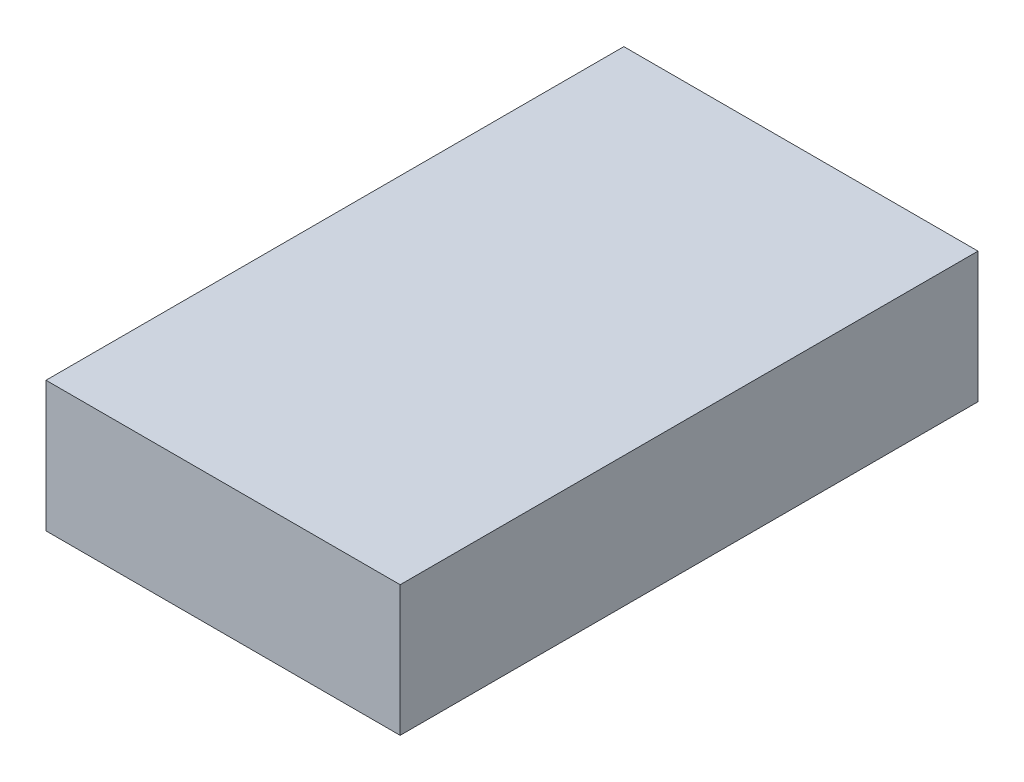
ISO-10303-21;
HEADER;
FILE_DESCRIPTION(('STEP AP214'),'2;1');
FILE_NAME('part.step','',(''),(''),'','','');
FILE_SCHEMA(('AUTOMOTIVE_DESIGN { 1 0 10303 214 1 1 1 1 }'));
ENDSEC;
DATA;
#1=APPLICATION_CONTEXT('core data for automotive mechanical design processes');
#2=APPLICATION_PROTOCOL_DEFINITION('international standard','automotive_design',2000,#1);
#3=PRODUCT_CONTEXT('',#1,'mechanical');
#4=PRODUCT('Part','Part','',(#3));
#5=PRODUCT_RELATED_PRODUCT_CATEGORY('part','',(#4));
#6=PRODUCT_DEFINITION_FORMATION('','',#4);
#7=PRODUCT_DEFINITION_CONTEXT('part definition',#1,'design');
#8=PRODUCT_DEFINITION('design','',#6,#7);
#9=PRODUCT_DEFINITION_SHAPE('','',#8);
#10=(LENGTH_UNIT() NAMED_UNIT(*) SI_UNIT(.MILLI.,.METRE.));
#11=(NAMED_UNIT(*) PLANE_ANGLE_UNIT() SI_UNIT($,.RADIAN.));
#12=(NAMED_UNIT(*) SI_UNIT($,.STERADIAN.) SOLID_ANGLE_UNIT());
#13=UNCERTAINTY_MEASURE_WITH_UNIT(LENGTH_MEASURE(1.E-05),#10,'distance_accuracy_value','');
#14=(GEOMETRIC_REPRESENTATION_CONTEXT(3) GLOBAL_UNCERTAINTY_ASSIGNED_CONTEXT((#13)) GLOBAL_UNIT_ASSIGNED_CONTEXT((#10,
#11,#12)) REPRESENTATION_CONTEXT('',''));
#15=CARTESIAN_POINT('',(0.,0.,0.));
#16=DIRECTION('',(0.,0.,1.));
#17=DIRECTION('',(1.,0.,0.));
#18=AXIS2_PLACEMENT_3D('',#15,#16,#17);
#19=CARTESIAN_POINT('',(0.,17.78,0.));
#20=DIRECTION('',(1.,0.,0.));
#21=DIRECTION('',(0.,0.,-1.));
#22=AXIS2_PLACEMENT_3D('',#19,#20,#21);
#23=PLANE('',#22);
#24=DIRECTION('',(0.,0.,1.));
#25=VECTOR('',#24,1.);
#26=CARTESIAN_POINT('',(0.,0.,0.));
#27=LINE('',#26,#25);
#28=CARTESIAN_POINT('',(0.,0.,-78.74));
#29=VERTEX_POINT('',#28);
#30=CARTESIAN_POINT('',(0.,0.,0.));
#31=VERTEX_POINT('',#30);
#32=EDGE_CURVE('E107',#29,#31,#27,.T.);
#33=ORIENTED_EDGE('',*,*,#32,.T.);
#34=DIRECTION('',(0.,-1.,0.));
#35=VECTOR('',#34,1.);
#36=CARTESIAN_POINT('',(0.,17.78,0.));
#37=LINE('',#36,#35);
#38=CARTESIAN_POINT('',(0.,17.78,0.));
#39=VERTEX_POINT('',#38);
#40=EDGE_CURVE('E11',#39,#31,#37,.T.);
#41=ORIENTED_EDGE('',*,*,#40,.F.);
#42=DIRECTION('',(0.,0.,1.));
#43=VECTOR('',#42,1.);
#44=CARTESIAN_POINT('',(0.,17.78,0.));
#45=LINE('',#44,#43);
#46=CARTESIAN_POINT('',(0.,17.78,-78.74));
#47=VERTEX_POINT('',#46);
#48=EDGE_CURVE('E91',#47,#39,#45,.T.);
#49=ORIENTED_EDGE('',*,*,#48,.F.);
#50=DIRECTION('',(0.,-1.,0.));
#51=VECTOR('',#50,1.);
#52=CARTESIAN_POINT('',(0.,17.78,-78.74));
#53=LINE('',#52,#51);
#54=EDGE_CURVE('E103',#47,#29,#53,.T.);
#55=ORIENTED_EDGE('',*,*,#54,.T.);
#56=EDGE_LOOP('',(#33,#41,#49,#55));
#57=FACE_BOUND('',#56,.T.);
#58=ADVANCED_FACE('F39',(#57),#23,.F.);
#59=CARTESIAN_POINT('',(0.,17.78,0.));
#60=DIRECTION('',(0.,0.,-1.));
#61=DIRECTION('',(-1.,0.,0.));
#62=AXIS2_PLACEMENT_3D('',#59,#60,#61);
#63=PLANE('',#62);
#64=DIRECTION('',(1.,0.,0.));
#65=VECTOR('',#64,1.);
#66=CARTESIAN_POINT('',(0.,0.,0.));
#67=LINE('',#66,#65);
#68=CARTESIAN_POINT('',(48.26,0.,0.));
#69=VERTEX_POINT('',#68);
#70=EDGE_CURVE('E96',#31,#69,#67,.T.);
#71=ORIENTED_EDGE('',*,*,#70,.T.);
#72=DIRECTION('',(0.,-1.,0.));
#73=VECTOR('',#72,1.);
#74=CARTESIAN_POINT('',(48.26,17.78,0.));
#75=LINE('',#74,#73);
#76=CARTESIAN_POINT('',(48.26,17.78,0.));
#77=VERTEX_POINT('',#76);
#78=EDGE_CURVE('E48',#77,#69,#75,.T.);
#79=ORIENTED_EDGE('',*,*,#78,.F.);
#80=DIRECTION('',(1.,0.,0.));
#81=VECTOR('',#80,1.);
#82=CARTESIAN_POINT('',(0.,17.78,0.));
#83=LINE('',#82,#81);
#84=EDGE_CURVE('E86',#39,#77,#83,.T.);
#85=ORIENTED_EDGE('',*,*,#84,.F.);
#86=ORIENTED_EDGE('',*,*,#40,.T.);
#87=EDGE_LOOP('',(#71,#79,#85,#86));
#88=FACE_BOUND('',#87,.T.);
#89=ADVANCED_FACE('F95',(#88),#63,.F.);
#90=CARTESIAN_POINT('',(48.26,17.78,0.));
#91=DIRECTION('',(-1.,0.,0.));
#92=DIRECTION('',(0.,0.,1.));
#93=AXIS2_PLACEMENT_3D('',#90,#91,#92);
#94=PLANE('',#93);
#95=DIRECTION('',(0.,0.,-1.));
#96=VECTOR('',#95,1.);
#97=CARTESIAN_POINT('',(48.26,0.,0.));
#98=LINE('',#97,#96);
#99=CARTESIAN_POINT('',(48.26,0.,-78.74));
#100=VERTEX_POINT('',#99);
#101=EDGE_CURVE('E73',#69,#100,#98,.T.);
#102=ORIENTED_EDGE('',*,*,#101,.T.);
#103=DIRECTION('',(0.,-1.,0.));
#104=VECTOR('',#103,1.);
#105=CARTESIAN_POINT('',(48.26,17.78,-78.74));
#106=LINE('',#105,#104);
#107=CARTESIAN_POINT('',(48.26,17.78,-78.74));
#108=VERTEX_POINT('',#107);
#109=EDGE_CURVE('E98',#108,#100,#106,.T.);
#110=ORIENTED_EDGE('',*,*,#109,.F.);
#111=DIRECTION('',(0.,0.,-1.));
#112=VECTOR('',#111,1.);
#113=CARTESIAN_POINT('',(48.26,17.78,0.));
#114=LINE('',#113,#112);
#115=EDGE_CURVE('E89',#77,#108,#114,.T.);
#116=ORIENTED_EDGE('',*,*,#115,.F.);
#117=ORIENTED_EDGE('',*,*,#78,.T.);
#118=EDGE_LOOP('',(#102,#110,#116,#117));
#119=FACE_BOUND('',#118,.T.);
#120=ADVANCED_FACE('F99',(#119),#94,.F.);
#121=CARTESIAN_POINT('',(0.,17.78,-78.74));
#122=DIRECTION('',(0.,0.,1.));
#123=DIRECTION('',(1.,0.,0.));
#124=AXIS2_PLACEMENT_3D('',#121,#122,#123);
#125=PLANE('',#124);
#126=DIRECTION('',(-1.,0.,0.));
#127=VECTOR('',#126,1.);
#128=CARTESIAN_POINT('',(0.,0.,-78.74));
#129=LINE('',#128,#127);
#130=EDGE_CURVE('E79',#100,#29,#129,.T.);
#131=ORIENTED_EDGE('',*,*,#130,.T.);
#132=ORIENTED_EDGE('',*,*,#54,.F.);
#133=DIRECTION('',(-1.,0.,0.));
#134=VECTOR('',#133,1.);
#135=CARTESIAN_POINT('',(0.,17.78,-78.74));
#136=LINE('',#135,#134);
#137=EDGE_CURVE('E56',#108,#47,#136,.T.);
#138=ORIENTED_EDGE('',*,*,#137,.F.);
#139=ORIENTED_EDGE('',*,*,#109,.T.);
#140=EDGE_LOOP('',(#131,#132,#138,#139));
#141=FACE_BOUND('',#140,.T.);
#142=ADVANCED_FACE('F120',(#141),#125,.F.);
#143=CARTESIAN_POINT('',(0.,17.78,0.));
#144=DIRECTION('',(0.,-1.,0.));
#145=DIRECTION('',(0.,0.,-1.));
#146=AXIS2_PLACEMENT_3D('',#143,#144,#145);
#147=PLANE('',#146);
#148=ORIENTED_EDGE('',*,*,#48,.T.);
#149=ORIENTED_EDGE('',*,*,#84,.T.);
#150=ORIENTED_EDGE('',*,*,#115,.T.);
#151=ORIENTED_EDGE('',*,*,#137,.T.);
#152=EDGE_LOOP('',(#148,#149,#150,#151));
#153=FACE_BOUND('',#152,.T.);
#154=ADVANCED_FACE('F87',(#153),#147,.F.);
#155=CARTESIAN_POINT('',(0.,0.,0.));
#156=DIRECTION('',(0.,-1.,0.));
#157=DIRECTION('',(0.,0.,-1.));
#158=AXIS2_PLACEMENT_3D('',#155,#156,#157);
#159=PLANE('',#158);
#160=ORIENTED_EDGE('',*,*,#32,.F.);
#161=ORIENTED_EDGE('',*,*,#130,.F.);
#162=ORIENTED_EDGE('',*,*,#101,.F.);
#163=ORIENTED_EDGE('',*,*,#70,.F.);
#164=EDGE_LOOP('',(#160,#161,#162,#163));
#165=FACE_BOUND('',#164,.T.);
#166=ADVANCED_FACE('F123',(#165),#159,.T.);
#167=CLOSED_SHELL('',(#58,#89,#120,#142,#154,#166));
#168=MANIFOLD_SOLID_BREP('B2',#167);
#169=ADVANCED_BREP_SHAPE_REPRESENTATION('',(#18,#168),#14);
#170=SHAPE_DEFINITION_REPRESENTATION(#9,#169);
ENDSEC;
END-ISO-10303-21;
